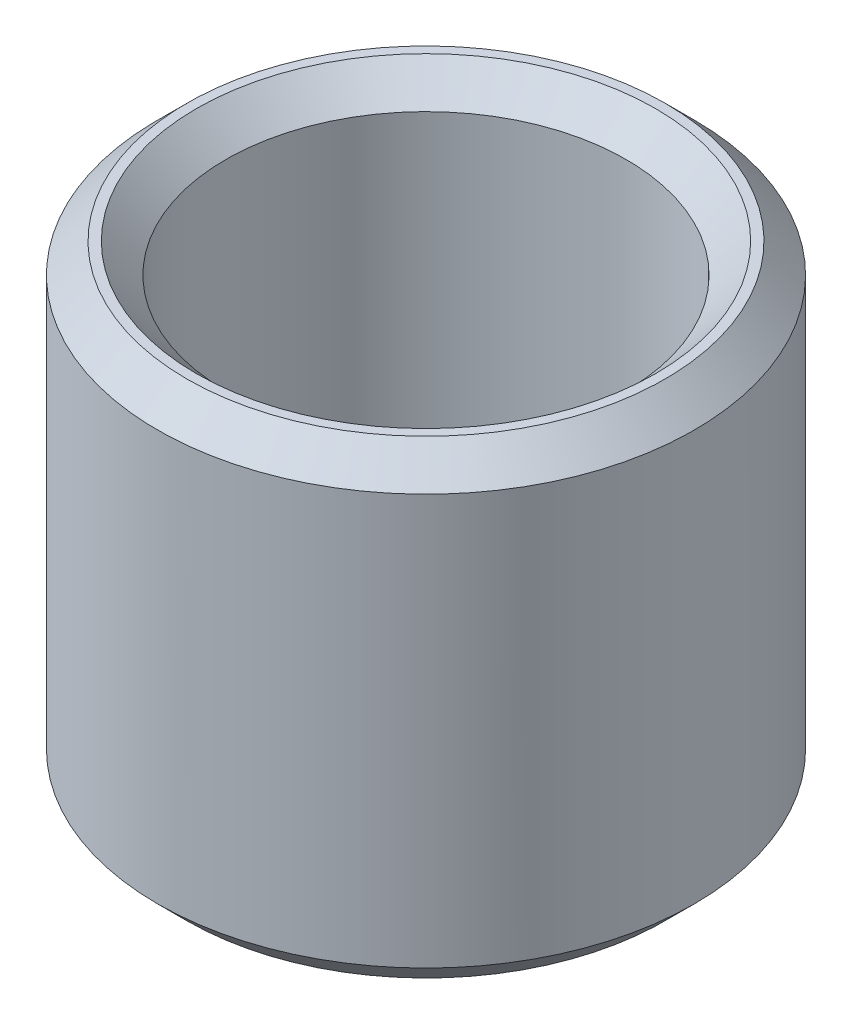
ISO-10303-21;
HEADER;
FILE_DESCRIPTION(('STEP AP214'),'2;1');
FILE_NAME('part.step','',(''),(''),'','','');
FILE_SCHEMA(('AUTOMOTIVE_DESIGN { 1 0 10303 214 1 1 1 1 }'));
ENDSEC;
DATA;
#1=APPLICATION_CONTEXT('core data for automotive mechanical design processes');
#2=APPLICATION_PROTOCOL_DEFINITION('international standard','automotive_design',2000,#1);
#3=PRODUCT_CONTEXT('',#1,'mechanical');
#4=PRODUCT('Part','Part','',(#3));
#5=PRODUCT_RELATED_PRODUCT_CATEGORY('part','',(#4));
#6=PRODUCT_DEFINITION_FORMATION('','',#4);
#7=PRODUCT_DEFINITION_CONTEXT('part definition',#1,'design');
#8=PRODUCT_DEFINITION('design','',#6,#7);
#9=PRODUCT_DEFINITION_SHAPE('','',#8);
#10=(LENGTH_UNIT() NAMED_UNIT(*) SI_UNIT(.MILLI.,.METRE.));
#11=(NAMED_UNIT(*) PLANE_ANGLE_UNIT() SI_UNIT($,.RADIAN.));
#12=(NAMED_UNIT(*) SI_UNIT($,.STERADIAN.) SOLID_ANGLE_UNIT());
#13=UNCERTAINTY_MEASURE_WITH_UNIT(LENGTH_MEASURE(1.E-05),#10,'distance_accuracy_value','');
#14=(GEOMETRIC_REPRESENTATION_CONTEXT(3) GLOBAL_UNCERTAINTY_ASSIGNED_CONTEXT((#13)) GLOBAL_UNIT_ASSIGNED_CONTEXT((#10,
#11,#12)) REPRESENTATION_CONTEXT('',''));
#15=CARTESIAN_POINT('',(0.,0.,0.));
#16=DIRECTION('',(0.,0.,1.));
#17=DIRECTION('',(1.,0.,0.));
#18=AXIS2_PLACEMENT_3D('',#15,#16,#17);
#19=CARTESIAN_POINT('',(0.,43.6998073855825,0.));
#20=DIRECTION('',(0.,-1.,0.));
#21=DIRECTION('',(0.,0.,-1.));
#22=AXIS2_PLACEMENT_3D('',#19,#20,#21);
#23=CYLINDRICAL_SURFACE('',#22,25.);
#24=CARTESIAN_POINT('',(0.,2.73829901812869,0.));
#25=DIRECTION('',(0.,1.,0.));
#26=DIRECTION('',(0.,0.,1.));
#27=AXIS2_PLACEMENT_3D('',#24,#25,#26);
#28=CIRCLE('',#27,25.);
#29=CARTESIAN_POINT('',(0.,2.73829901812869,25.));
#30=VERTEX_POINT('',#29);
#31=EDGE_CURVE('E10',#30,#30,#28,.T.);
#32=ORIENTED_EDGE('',*,*,#31,.T.);
#33=EDGE_LOOP('',(#32));
#34=FACE_BOUND('',#33,.T.);
#35=CARTESIAN_POINT('',(0.,40.9615083674537,0.));
#36=DIRECTION('',(0.,1.,0.));
#37=DIRECTION('',(0.,0.,1.));
#38=AXIS2_PLACEMENT_3D('',#35,#36,#37);
#39=CIRCLE('',#38,25.);
#40=CARTESIAN_POINT('',(0.,40.9615083674537,-25.));
#41=VERTEX_POINT('',#40);
#42=EDGE_CURVE('E50',#41,#41,#39,.F.);
#43=ORIENTED_EDGE('',*,*,#42,.T.);
#44=EDGE_LOOP('',(#43));
#45=FACE_BOUND('',#44,.T.);
#46=ADVANCED_FACE('F39',(#34,#45),#23,.T.);
#47=CARTESIAN_POINT('',(0.,43.6998073855825,0.));
#48=DIRECTION('',(0.,1.,0.));
#49=DIRECTION('',(0.,0.,1.));
#50=AXIS2_PLACEMENT_3D('',#47,#48,#49);
#51=PLANE('',#50);
#52=CARTESIAN_POINT('',(0.,43.6998073855825,0.));
#53=DIRECTION('',(0.,1.,0.));
#54=DIRECTION('',(0.,0.,1.));
#55=AXIS2_PLACEMENT_3D('',#52,#53,#54);
#56=CIRCLE('',#55,21.3841499240904);
#57=CARTESIAN_POINT('',(0.,43.6998073855825,21.3841499240904));
#58=VERTEX_POINT('',#57);
#59=EDGE_CURVE('E58',#58,#58,#56,.F.);
#60=ORIENTED_EDGE('',*,*,#59,.T.);
#61=EDGE_LOOP('',(#60));
#62=FACE_BOUND('',#61,.T.);
#63=CARTESIAN_POINT('',(0.,43.6998073855825,0.));
#64=DIRECTION('',(0.,1.,0.));
#65=DIRECTION('',(0.,0.,1.));
#66=AXIS2_PLACEMENT_3D('',#63,#64,#65);
#67=CIRCLE('',#66,22.2617009818713);
#68=CARTESIAN_POINT('',(0.,43.6998073855825,-22.2617009818713));
#69=VERTEX_POINT('',#68);
#70=EDGE_CURVE('E61',#69,#69,#67,.T.);
#71=ORIENTED_EDGE('',*,*,#70,.T.);
#72=EDGE_LOOP('',(#71));
#73=FACE_BOUND('',#72,.T.);
#74=ADVANCED_FACE('F88',(#62,#73),#51,.T.);
#75=CARTESIAN_POINT('',(0.,0.,0.));
#76=DIRECTION('',(0.,1.,0.));
#77=DIRECTION('',(0.,0.,1.));
#78=AXIS2_PLACEMENT_3D('',#75,#76,#77);
#79=PLANE('',#78);
#80=CARTESIAN_POINT('',(0.,0.,0.));
#81=DIRECTION('',(0.,1.,0.));
#82=DIRECTION('',(0.,0.,1.));
#83=AXIS2_PLACEMENT_3D('',#80,#81,#82);
#84=CIRCLE('',#83,21.3841499240904);
#85=CARTESIAN_POINT('',(0.,0.,21.3841499240904));
#86=VERTEX_POINT('',#85);
#87=EDGE_CURVE('E51',#86,#86,#84,.T.);
#88=ORIENTED_EDGE('',*,*,#87,.T.);
#89=EDGE_LOOP('',(#88));
#90=FACE_BOUND('',#89,.T.);
#91=CARTESIAN_POINT('',(0.,0.,0.));
#92=DIRECTION('',(0.,1.,0.));
#93=DIRECTION('',(0.,0.,1.));
#94=AXIS2_PLACEMENT_3D('',#91,#92,#93);
#95=CIRCLE('',#94,22.2617009818713);
#96=CARTESIAN_POINT('',(0.,0.,22.2617009818713));
#97=VERTEX_POINT('',#96);
#98=EDGE_CURVE('E54',#97,#97,#95,.F.);
#99=ORIENTED_EDGE('',*,*,#98,.T.);
#100=EDGE_LOOP('',(#99));
#101=FACE_BOUND('',#100,.T.);
#102=ADVANCED_FACE('F83',(#90,#101),#79,.F.);
#103=CARTESIAN_POINT('',(0.,43.6998073855825,0.));
#104=DIRECTION('',(0.,-1.,0.));
#105=DIRECTION('',(0.,0.,-1.));
#106=AXIS2_PLACEMENT_3D('',#103,#104,#105);
#107=CYLINDRICAL_SURFACE('',#106,18.6458509059616);
#108=CARTESIAN_POINT('',(0.,40.9615083674538,0.));
#109=DIRECTION('',(0.,1.,0.));
#110=DIRECTION('',(0.,0.,1.));
#111=AXIS2_PLACEMENT_3D('',#108,#109,#110);
#112=CIRCLE('',#111,18.6458509059616);
#113=CARTESIAN_POINT('',(0.,40.9615083674538,18.6458509059616));
#114=VERTEX_POINT('',#113);
#115=EDGE_CURVE('E67',#114,#114,#112,.T.);
#116=ORIENTED_EDGE('',*,*,#115,.T.);
#117=EDGE_LOOP('',(#116));
#118=FACE_BOUND('',#117,.T.);
#119=CARTESIAN_POINT('',(0.,2.73829901812872,0.));
#120=DIRECTION('',(0.,1.,0.));
#121=DIRECTION('',(0.,0.,1.));
#122=AXIS2_PLACEMENT_3D('',#119,#120,#121);
#123=CIRCLE('',#122,18.6458509059616);
#124=CARTESIAN_POINT('',(0.,2.73829901812872,18.6458509059616));
#125=VERTEX_POINT('',#124);
#126=EDGE_CURVE('E69',#125,#125,#123,.F.);
#127=ORIENTED_EDGE('',*,*,#126,.T.);
#128=EDGE_LOOP('',(#127));
#129=FACE_BOUND('',#128,.T.);
#130=ADVANCED_FACE('F71',(#118,#129),#107,.F.);
#131=CARTESIAN_POINT('',(0.,40.9615083674538,0.));
#132=DIRECTION('',(0.,1.,0.));
#133=DIRECTION('',(0.,0.,1.));
#134=AXIS2_PLACEMENT_3D('',#131,#132,#133);
#135=CONICAL_SURFACE('',#134,18.6458509059616,0.78539816339745);
#136=ORIENTED_EDGE('',*,*,#59,.F.);
#137=EDGE_LOOP('',(#136));
#138=FACE_BOUND('',#137,.T.);
#139=ORIENTED_EDGE('',*,*,#115,.F.);
#140=EDGE_LOOP('',(#139));
#141=FACE_BOUND('',#140,.T.);
#142=ADVANCED_FACE('F77',(#138,#141),#135,.F.);
#143=CARTESIAN_POINT('',(0.,0.,0.));
#144=DIRECTION('',(0.,-1.,0.));
#145=DIRECTION('',(0.,0.,-1.));
#146=AXIS2_PLACEMENT_3D('',#143,#144,#145);
#147=CONICAL_SURFACE('',#146,21.3841499240904,0.785398163397446);
#148=ORIENTED_EDGE('',*,*,#126,.F.);
#149=EDGE_LOOP('',(#148));
#150=FACE_BOUND('',#149,.T.);
#151=ORIENTED_EDGE('',*,*,#87,.F.);
#152=EDGE_LOOP('',(#151));
#153=FACE_BOUND('',#152,.T.);
#154=ADVANCED_FACE('F73',(#150,#153),#147,.F.);
#155=CARTESIAN_POINT('',(0.,2.73829901812869,0.));
#156=DIRECTION('',(0.,1.,0.));
#157=DIRECTION('',(0.,0.,1.));
#158=AXIS2_PLACEMENT_3D('',#155,#156,#157);
#159=CONICAL_SURFACE('',#158,25.,0.785398163397453);
#160=ORIENTED_EDGE('',*,*,#98,.F.);
#161=EDGE_LOOP('',(#160));
#162=FACE_BOUND('',#161,.T.);
#163=ORIENTED_EDGE('',*,*,#31,.F.);
#164=EDGE_LOOP('',(#163));
#165=FACE_BOUND('',#164,.T.);
#166=ADVANCED_FACE('F76',(#162,#165),#159,.T.);
#167=CARTESIAN_POINT('',(0.,43.6998073855825,0.));
#168=DIRECTION('',(0.,-1.,0.));
#169=DIRECTION('',(0.,0.,-1.));
#170=AXIS2_PLACEMENT_3D('',#167,#168,#169);
#171=CONICAL_SURFACE('',#170,22.2617009818713,0.785398163397445);
#172=CARTESIAN_POINT('',(0.,40.9615083674537,-25.));
#173=CARTESIAN_POINT('',(0.,40.9900323155593,-24.9714760518945));
#174=CARTESIAN_POINT('',(0.,41.0185562636648,-24.942952103789));
#175=CARTESIAN_POINT('',(0.,41.0756041598758,-24.885904207578));
#176=CARTESIAN_POINT('',(0.,41.1041281079813,-24.8573802594725));
#177=CARTESIAN_POINT('',(0.,41.1611760041923,-24.8003323632615));
#178=CARTESIAN_POINT('',(0.,41.1896999522978,-24.7718084151559));
#179=CARTESIAN_POINT('',(0.,41.2467478485088,-24.7147605189449));
#180=CARTESIAN_POINT('',(0.,41.2752717966143,-24.6862365708394));
#181=CARTESIAN_POINT('',(0.,41.3323196928253,-24.6291886746284));
#182=CARTESIAN_POINT('',(0.,41.3608436409309,-24.6006647265229));
#183=CARTESIAN_POINT('',(0.,41.4178915371419,-24.5436168303119));
#184=CARTESIAN_POINT('',(0.,41.4464154852474,-24.5150928822064));
#185=CARTESIAN_POINT('',(0.,41.5034633814584,-24.4580449859954));
#186=CARTESIAN_POINT('',(0.,41.5319873295639,-24.4295210378899));
#187=CARTESIAN_POINT('',(0.,41.5890352257749,-24.3724731416788));
#188=CARTESIAN_POINT('',(0.,41.6175591738804,-24.3439491935733));
#189=CARTESIAN_POINT('',(0.,41.6746070700914,-24.2869012973623));
#190=CARTESIAN_POINT('',(0.,41.7031310181969,-24.2583773492568));
#191=CARTESIAN_POINT('',(0.,41.760178914408,-24.2013294530458));
#192=CARTESIAN_POINT('',(0.,41.7887028625135,-24.1728055049403));
#193=CARTESIAN_POINT('',(0.,41.8457507587245,-24.1157576087293));
#194=CARTESIAN_POINT('',(0.,41.87427470683,-24.0872336606238));
#195=CARTESIAN_POINT('',(0.,41.931322603041,-24.0301857644127));
#196=CARTESIAN_POINT('',(0.,41.9598465511465,-24.0016618163072));
#197=CARTESIAN_POINT('',(0.,42.0168944473575,-23.9446139200962));
#198=CARTESIAN_POINT('',(0.,42.045418395463,-23.9160899719907));
#199=CARTESIAN_POINT('',(0.,42.102466291674,-23.8590420757797));
#200=CARTESIAN_POINT('',(0.,42.1309902397796,-23.8305181276742));
#201=CARTESIAN_POINT('',(0.,42.1880381359906,-23.7734702314632));
#202=CARTESIAN_POINT('',(0.,42.2165620840961,-23.7449462833577));
#203=CARTESIAN_POINT('',(0.,42.2736099803071,-23.6878983871467));
#204=CARTESIAN_POINT('',(0.,42.3021339284126,-23.6593744390412));
#205=CARTESIAN_POINT('',(0.,42.3591818246236,-23.6023265428301));
#206=CARTESIAN_POINT('',(0.,42.3877057727291,-23.5738025947246));
#207=CARTESIAN_POINT('',(0.,42.4447536689401,-23.5167546985136));
#208=CARTESIAN_POINT('',(0.,42.4732776170456,-23.4882307504081));
#209=CARTESIAN_POINT('',(0.,42.5303255132567,-23.4311828541971));
#210=CARTESIAN_POINT('',(0.,42.5588494613622,-23.4026589060916));
#211=CARTESIAN_POINT('',(0.,42.6158973575732,-23.3456110098806));
#212=CARTESIAN_POINT('',(0.,42.6444213056787,-23.3170870617751));
#213=CARTESIAN_POINT('',(0.,42.7014692018897,-23.2600391655641));
#214=CARTESIAN_POINT('',(0.,42.7299931499952,-23.2315152174586));
#215=CARTESIAN_POINT('',(0.,42.7870410462062,-23.1744673212475));
#216=CARTESIAN_POINT('',(0.,42.8155649943117,-23.145943373142));
#217=CARTESIAN_POINT('',(0.,42.8726128905228,-23.088895476931));
#218=CARTESIAN_POINT('',(0.,42.9011368386283,-23.0603715288255));
#219=CARTESIAN_POINT('',(0.,42.9581847348393,-23.0033236326145));
#220=CARTESIAN_POINT('',(0.,42.9867086829448,-22.974799684509));
#221=CARTESIAN_POINT('',(0.,43.0437565791558,-22.917751788298));
#222=CARTESIAN_POINT('',(0.,43.0722805272613,-22.8892278401925));
#223=CARTESIAN_POINT('',(0.,43.1293284234723,-22.8321799439814));
#224=CARTESIAN_POINT('',(0.,43.1578523715778,-22.8036559958759));
#225=CARTESIAN_POINT('',(0.,43.2149002677888,-22.7466080996649));
#226=CARTESIAN_POINT('',(0.,43.2434242158944,-22.7180841515594));
#227=CARTESIAN_POINT('',(0.,43.3004721121054,-22.6610362553484));
#228=CARTESIAN_POINT('',(0.,43.3289960602109,-22.6325123072429));
#229=CARTESIAN_POINT('',(0.,43.3860439564219,-22.5754644110319));
#230=CARTESIAN_POINT('',(0.,43.4145679045274,-22.5469404629264));
#231=CARTESIAN_POINT('',(0.,43.4716158007384,-22.4898925667154));
#232=CARTESIAN_POINT('',(0.,43.5001397488439,-22.4613686186098));
#233=CARTESIAN_POINT('',(0.,43.5571876450549,-22.4043207223988));
#234=CARTESIAN_POINT('',(0.,43.5857115931604,-22.3757967742933));
#235=CARTESIAN_POINT('',(0.,43.6427594893715,-22.3187488780823));
#236=CARTESIAN_POINT('',(0.,43.671283437477,-22.2902249299768));
#237=CARTESIAN_POINT('',(0.,43.6998073855825,-22.2617009818713));
#238=B_SPLINE_CURVE_WITH_KNOTS('',3,(#172,#173,#174,#175,#176,#177,#178,#179,#180,#181,#182,
#183,#184,#185,#186,#187,#188,#189,#190,#191,#192,#193,#194,#195,#196,#197,#198,#199,#200,#201,
#202,#203,#204,#205,#206,#207,#208,#209,#210,#211,#212,#213,#214,#215,#216,#217,#218,#219,#220,
#221,#222,#223,#224,#225,#226,#227,#228,#229,#230,#231,#232,#233,#234,#235,#236,#237),
.UNSPECIFIED.,.F.,.F.,(4,2,2,2,2,2,2,2,2,2,2,2,2,2,2,2,2,2,2,2,2,2,2,2,2,2,2,2,2,2,2,2,4),(0.,
0.121016862789703,0.24203372557941,0.363050588369113,0.484067451158818,0.605084313948521,
0.726101176738229,0.847118039527931,0.968134902317639,1.08915176510734,1.21016862789705,
1.33118549068675,1.45220235347646,1.57321921626616,1.69423607905587,1.81525294184558,
1.93626980463528,2.05728666742499,2.17830353021469,2.2993203930044,2.4203372557941,
2.5413541185838,2.66237098137351,2.78338784416321,2.90440470695292,3.02542156974262,
3.14643843253233,3.26745529532203,3.38847215811174,3.50948902090144,3.63050588369115,
3.75152274648085,3.87253960927056),.UNSPECIFIED.);
#239=EDGE_CURVE('BSEAM45',#41,#69,#238,.T.);
#240=ORIENTED_EDGE('',*,*,#42,.F.);
#241=ORIENTED_EDGE('',*,*,#70,.F.);
#242=ORIENTED_EDGE('',*,*,#239,.T.);
#243=ORIENTED_EDGE('',*,*,#239,.F.);
#244=EDGE_LOOP('',(#240,#242,#241,#243));
#245=FACE_BOUND('',#244,.T.);
#246=ADVANCED_FACE('F45',(#245),#171,.T.);
#247=CLOSED_SHELL('',(#46,#74,#102,#130,#142,#154,#166,#246));
#248=MANIFOLD_SOLID_BREP('B2',#247);
#249=ADVANCED_BREP_SHAPE_REPRESENTATION('',(#18,#248),#14);
#250=SHAPE_DEFINITION_REPRESENTATION(#9,#249);
ENDSEC;
END-ISO-10303-21;
